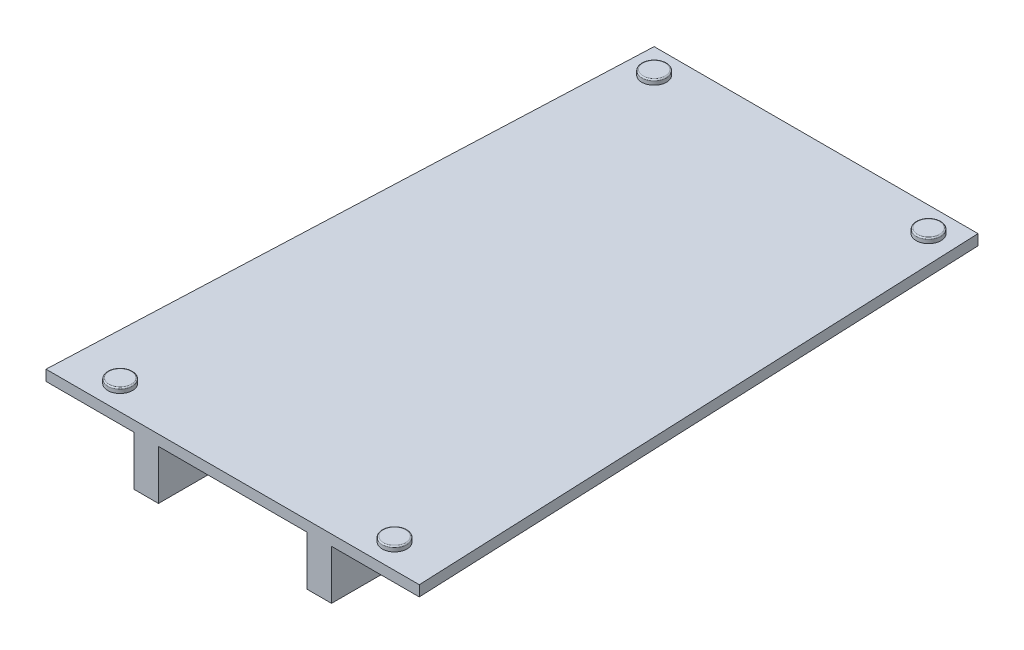
ISO-10303-21;
HEADER;
FILE_DESCRIPTION(('STEP AP214'),'2;1');
FILE_NAME('part.step','',(''),(''),'','','');
FILE_SCHEMA(('AUTOMOTIVE_DESIGN { 1 0 10303 214 1 1 1 1 }'));
ENDSEC;
DATA;
#1=APPLICATION_CONTEXT('core data for automotive mechanical design processes');
#2=APPLICATION_PROTOCOL_DEFINITION('international standard','automotive_design',2000,#1);
#3=PRODUCT_CONTEXT('',#1,'mechanical');
#4=PRODUCT('Part','Part','',(#3));
#5=PRODUCT_RELATED_PRODUCT_CATEGORY('part','',(#4));
#6=PRODUCT_DEFINITION_FORMATION('','',#4);
#7=PRODUCT_DEFINITION_CONTEXT('part definition',#1,'design');
#8=PRODUCT_DEFINITION('design','',#6,#7);
#9=PRODUCT_DEFINITION_SHAPE('','',#8);
#10=(LENGTH_UNIT() NAMED_UNIT(*) SI_UNIT(.MILLI.,.METRE.));
#11=(NAMED_UNIT(*) PLANE_ANGLE_UNIT() SI_UNIT($,.RADIAN.));
#12=(NAMED_UNIT(*) SI_UNIT($,.STERADIAN.) SOLID_ANGLE_UNIT());
#13=UNCERTAINTY_MEASURE_WITH_UNIT(LENGTH_MEASURE(1.E-05),#10,'distance_accuracy_value','');
#14=(GEOMETRIC_REPRESENTATION_CONTEXT(3) GLOBAL_UNCERTAINTY_ASSIGNED_CONTEXT((#13)) GLOBAL_UNIT_ASSIGNED_CONTEXT((#10,
#11,#12)) REPRESENTATION_CONTEXT('',''));
#15=CARTESIAN_POINT('',(0.,0.,0.));
#16=DIRECTION('',(0.,0.,1.));
#17=DIRECTION('',(1.,0.,0.));
#18=AXIS2_PLACEMENT_3D('',#15,#16,#17);
#19=CARTESIAN_POINT('',(0.,0.,0.));
#20=DIRECTION('',(0.,1.,0.));
#21=DIRECTION('',(0.,0.,1.));
#22=AXIS2_PLACEMENT_3D('',#19,#20,#21);
#23=PLANE('',#22);
#24=DIRECTION('',(0.,0.,-1.));
#25=VECTOR('',#24,1.);
#26=CARTESIAN_POINT('',(30.,0.,-118.));
#27=LINE('',#26,#25);
#28=CARTESIAN_POINT('',(30.,0.,118.));
#29=VERTEX_POINT('',#28);
#30=CARTESIAN_POINT('',(30.,0.,-118.));
#31=VERTEX_POINT('',#30);
#32=EDGE_CURVE('E268',#29,#31,#27,.T.);
#33=ORIENTED_EDGE('',*,*,#32,.F.);
#34=DIRECTION('',(1.,0.,0.));
#35=VECTOR('',#34,1.);
#36=CARTESIAN_POINT('',(0.,0.,118.));
#37=LINE('',#36,#35);
#38=CARTESIAN_POINT('',(-30.,0.,118.));
#39=VERTEX_POINT('',#38);
#40=EDGE_CURVE('E63',#39,#29,#37,.T.);
#41=ORIENTED_EDGE('',*,*,#40,.F.);
#42=DIRECTION('',(0.,0.,1.));
#43=VECTOR('',#42,1.);
#44=CARTESIAN_POINT('',(-30.,0.,-118.));
#45=LINE('',#44,#43);
#46=CARTESIAN_POINT('',(-30.,0.,-118.));
#47=VERTEX_POINT('',#46);
#48=EDGE_CURVE('E153',#47,#39,#45,.T.);
#49=ORIENTED_EDGE('',*,*,#48,.F.);
#50=DIRECTION('',(1.,0.,0.));
#51=VECTOR('',#50,1.);
#52=CARTESIAN_POINT('',(0.,0.,-118.));
#53=LINE('',#52,#51);
#54=EDGE_CURVE('E196',#47,#31,#53,.T.);
#55=ORIENTED_EDGE('',*,*,#54,.T.);
#56=EDGE_LOOP('',(#33,#41,#49,#55));
#57=FACE_BOUND('',#56,.T.);
#58=ADVANCED_FACE('F38',(#57),#23,.F.);
#59=DIRECTION('',(0.,0.,1.));
#60=VECTOR('',#59,1.);
#61=CARTESIAN_POINT('',(40.,0.,118.));
#62=LINE('',#61,#60);
#63=CARTESIAN_POINT('',(40.,0.,-118.));
#64=VERTEX_POINT('',#63);
#65=CARTESIAN_POINT('',(40.,0.,118.));
#66=VERTEX_POINT('',#65);
#67=EDGE_CURVE('E145',#64,#66,#62,.T.);
#68=ORIENTED_EDGE('',*,*,#67,.F.);
#69=CARTESIAN_POINT('',(65.5,0.,-118.));
#70=VERTEX_POINT('',#69);
#71=EDGE_CURVE('E180',#64,#70,#53,.T.);
#72=ORIENTED_EDGE('',*,*,#71,.T.);
#73=DIRECTION('',(0.0423348930736045,0.,0.999103476537063));
#74=VECTOR('',#73,1.);
#75=CARTESIAN_POINT('',(70.3736468564055,0.,-2.98193418883075));
#76=LINE('',#75,#74);
#77=CARTESIAN_POINT('',(75.5,0.,118.));
#78=VERTEX_POINT('',#77);
#79=EDGE_CURVE('E185',#70,#78,#76,.T.);
#80=ORIENTED_EDGE('',*,*,#79,.T.);
#81=EDGE_CURVE('E198',#66,#78,#37,.T.);
#82=ORIENTED_EDGE('',*,*,#81,.F.);
#83=EDGE_LOOP('',(#68,#72,#80,#82));
#84=FACE_BOUND('',#83,.T.);
#85=ADVANCED_FACE('F282',(#84),#23,.F.);
#86=DIRECTION('',(0.,0.,-1.));
#87=VECTOR('',#86,1.);
#88=CARTESIAN_POINT('',(-40.,0.,118.));
#89=LINE('',#88,#87);
#90=CARTESIAN_POINT('',(-40.,0.,118.));
#91=VERTEX_POINT('',#90);
#92=CARTESIAN_POINT('',(-40.,0.,-118.));
#93=VERTEX_POINT('',#92);
#94=EDGE_CURVE('E150',#91,#93,#89,.T.);
#95=ORIENTED_EDGE('',*,*,#94,.F.);
#96=CARTESIAN_POINT('',(-75.5,0.,118.));
#97=VERTEX_POINT('',#96);
#98=EDGE_CURVE('E199',#97,#91,#37,.T.);
#99=ORIENTED_EDGE('',*,*,#98,.F.);
#100=DIRECTION('',(-0.0423348930736043,0.,0.999103476537064));
#101=VECTOR('',#100,1.);
#102=CARTESIAN_POINT('',(-70.3736468564055,0.,-2.98193418883073));
#103=LINE('',#102,#101);
#104=CARTESIAN_POINT('',(-65.5,0.,-118.));
#105=VERTEX_POINT('',#104);
#106=EDGE_CURVE('E195',#105,#97,#103,.T.);
#107=ORIENTED_EDGE('',*,*,#106,.F.);
#108=EDGE_CURVE('E193',#105,#93,#53,.T.);
#109=ORIENTED_EDGE('',*,*,#108,.T.);
#110=EDGE_LOOP('',(#95,#99,#107,#109));
#111=FACE_BOUND('',#110,.T.);
#112=ADVANCED_FACE('F303',(#111),#23,.F.);
#113=CARTESIAN_POINT('',(0.,4.3,-118.));
#114=DIRECTION('',(0.,0.,-1.));
#115=DIRECTION('',(-1.,0.,0.));
#116=AXIS2_PLACEMENT_3D('',#113,#114,#115);
#117=PLANE('',#116);
#118=ORIENTED_EDGE('',*,*,#108,.F.);
#119=DIRECTION('',(0.,-1.,0.));
#120=VECTOR('',#119,1.);
#121=CARTESIAN_POINT('',(-65.5,4.3,-118.));
#122=LINE('',#121,#120);
#123=CARTESIAN_POINT('',(-65.5,4.3,-118.));
#124=VERTEX_POINT('',#123);
#125=EDGE_CURVE('E211',#124,#105,#122,.T.);
#126=ORIENTED_EDGE('',*,*,#125,.F.);
#127=DIRECTION('',(1.,0.,0.));
#128=VECTOR('',#127,1.);
#129=CARTESIAN_POINT('',(0.,4.3,-118.));
#130=LINE('',#129,#128);
#131=CARTESIAN_POINT('',(65.5,4.3,-118.));
#132=VERTEX_POINT('',#131);
#133=EDGE_CURVE('E181',#124,#132,#130,.T.);
#134=ORIENTED_EDGE('',*,*,#133,.T.);
#135=DIRECTION('',(0.,-1.,0.));
#136=VECTOR('',#135,1.);
#137=CARTESIAN_POINT('',(65.5,4.3,-118.));
#138=LINE('',#137,#136);
#139=EDGE_CURVE('E192',#132,#70,#138,.T.);
#140=ORIENTED_EDGE('',*,*,#139,.T.);
#141=ORIENTED_EDGE('',*,*,#71,.F.);
#142=DIRECTION('',(0.,1.,0.));
#143=VECTOR('',#142,1.);
#144=CARTESIAN_POINT('',(40.,-20.,-118.));
#145=LINE('',#144,#143);
#146=CARTESIAN_POINT('',(40.,-20.,-118.));
#147=VERTEX_POINT('',#146);
#148=EDGE_CURVE('E155',#147,#64,#145,.T.);
#149=ORIENTED_EDGE('',*,*,#148,.F.);
#150=DIRECTION('',(1.,0.,0.));
#151=VECTOR('',#150,1.);
#152=CARTESIAN_POINT('',(40.,-20.,-118.));
#153=LINE('',#152,#151);
#154=CARTESIAN_POINT('',(30.,-20.,-118.));
#155=VERTEX_POINT('',#154);
#156=EDGE_CURVE('E139',#155,#147,#153,.T.);
#157=ORIENTED_EDGE('',*,*,#156,.F.);
#158=DIRECTION('',(0.,1.,0.));
#159=VECTOR('',#158,1.);
#160=CARTESIAN_POINT('',(30.,-20.,-118.));
#161=LINE('',#160,#159);
#162=EDGE_CURVE('E136',#155,#31,#161,.T.);
#163=ORIENTED_EDGE('',*,*,#162,.T.);
#164=ORIENTED_EDGE('',*,*,#54,.F.);
#165=DIRECTION('',(0.,1.,0.));
#166=VECTOR('',#165,1.);
#167=CARTESIAN_POINT('',(-30.,-20.,-118.));
#168=LINE('',#167,#166);
#169=CARTESIAN_POINT('',(-30.,-20.,-118.));
#170=VERTEX_POINT('',#169);
#171=EDGE_CURVE('E171',#170,#47,#168,.T.);
#172=ORIENTED_EDGE('',*,*,#171,.F.);
#173=DIRECTION('',(1.,0.,0.));
#174=VECTOR('',#173,1.);
#175=CARTESIAN_POINT('',(-40.,-20.,-118.));
#176=LINE('',#175,#174);
#177=CARTESIAN_POINT('',(-40.,-20.,-118.));
#178=VERTEX_POINT('',#177);
#179=EDGE_CURVE('E164',#178,#170,#176,.T.);
#180=ORIENTED_EDGE('',*,*,#179,.F.);
#181=DIRECTION('',(0.,1.,0.));
#182=VECTOR('',#181,1.);
#183=CARTESIAN_POINT('',(-40.,-20.,-118.));
#184=LINE('',#183,#182);
#185=EDGE_CURVE('E174',#178,#93,#184,.T.);
#186=ORIENTED_EDGE('',*,*,#185,.T.);
#187=EDGE_LOOP('',(#118,#126,#134,#140,#141,#149,#157,#163,#164,#172,#180,#186));
#188=FACE_BOUND('',#187,.T.);
#189=ADVANCED_FACE('F284',(#188),#117,.T.);
#190=CARTESIAN_POINT('',(-70.3736468564055,4.3,-2.98193418883073));
#191=DIRECTION('',(0.999103476537063,0.,0.0423348930736043));
#192=DIRECTION('',(0.0423348930736043,0.,-0.999103476537064));
#193=AXIS2_PLACEMENT_3D('',#190,#191,#192);
#194=PLANE('',#193);
#195=ORIENTED_EDGE('',*,*,#106,.T.);
#196=DIRECTION('',(0.,-1.,0.));
#197=VECTOR('',#196,1.);
#198=CARTESIAN_POINT('',(-75.5,4.3,118.));
#199=LINE('',#198,#197);
#200=CARTESIAN_POINT('',(-75.5,4.3,118.));
#201=VERTEX_POINT('',#200);
#202=EDGE_CURVE('E208',#201,#97,#199,.T.);
#203=ORIENTED_EDGE('',*,*,#202,.F.);
#204=DIRECTION('',(-0.0423348930736043,0.,0.999103476537064));
#205=VECTOR('',#204,1.);
#206=CARTESIAN_POINT('',(-70.3736468564055,4.3,-2.98193418883073));
#207=LINE('',#206,#205);
#208=EDGE_CURVE('E184',#124,#201,#207,.T.);
#209=ORIENTED_EDGE('',*,*,#208,.F.);
#210=ORIENTED_EDGE('',*,*,#125,.T.);
#211=EDGE_LOOP('',(#195,#203,#209,#210));
#212=FACE_BOUND('',#211,.T.);
#213=ADVANCED_FACE('F310',(#212),#194,.F.);
#214=CARTESIAN_POINT('',(0.,4.3,118.));
#215=DIRECTION('',(0.,0.,-1.));
#216=DIRECTION('',(-1.,0.,0.));
#217=AXIS2_PLACEMENT_3D('',#214,#215,#216);
#218=PLANE('',#217);
#219=ORIENTED_EDGE('',*,*,#98,.T.);
#220=DIRECTION('',(0.,1.,0.));
#221=VECTOR('',#220,1.);
#222=CARTESIAN_POINT('',(-40.,-20.,118.));
#223=LINE('',#222,#221);
#224=CARTESIAN_POINT('',(-40.,-20.,118.));
#225=VERTEX_POINT('',#224);
#226=EDGE_CURVE('E177',#225,#91,#223,.T.);
#227=ORIENTED_EDGE('',*,*,#226,.F.);
#228=DIRECTION('',(-1.,0.,0.));
#229=VECTOR('',#228,1.);
#230=CARTESIAN_POINT('',(-30.,-20.,118.));
#231=LINE('',#230,#229);
#232=CARTESIAN_POINT('',(-30.,-20.,118.));
#233=VERTEX_POINT('',#232);
#234=EDGE_CURVE('E159',#233,#225,#231,.T.);
#235=ORIENTED_EDGE('',*,*,#234,.F.);
#236=DIRECTION('',(0.,1.,0.));
#237=VECTOR('',#236,1.);
#238=CARTESIAN_POINT('',(-30.,-20.,118.));
#239=LINE('',#238,#237);
#240=EDGE_CURVE('E167',#233,#39,#239,.T.);
#241=ORIENTED_EDGE('',*,*,#240,.T.);
#242=ORIENTED_EDGE('',*,*,#40,.T.);
#243=DIRECTION('',(0.,1.,0.));
#244=VECTOR('',#243,1.);
#245=CARTESIAN_POINT('',(30.,-20.,118.));
#246=LINE('',#245,#244);
#247=CARTESIAN_POINT('',(30.,-20.,118.));
#248=VERTEX_POINT('',#247);
#249=EDGE_CURVE('E134',#248,#29,#246,.T.);
#250=ORIENTED_EDGE('',*,*,#249,.F.);
#251=DIRECTION('',(-1.,0.,0.));
#252=VECTOR('',#251,1.);
#253=CARTESIAN_POINT('',(30.,-20.,118.));
#254=LINE('',#253,#252);
#255=CARTESIAN_POINT('',(40.,-20.,118.));
#256=VERTEX_POINT('',#255);
#257=EDGE_CURVE('E140',#256,#248,#254,.T.);
#258=ORIENTED_EDGE('',*,*,#257,.F.);
#259=DIRECTION('',(0.,1.,0.));
#260=VECTOR('',#259,1.);
#261=CARTESIAN_POINT('',(40.,-20.,118.));
#262=LINE('',#261,#260);
#263=EDGE_CURVE('E55',#256,#66,#262,.T.);
#264=ORIENTED_EDGE('',*,*,#263,.T.);
#265=ORIENTED_EDGE('',*,*,#81,.T.);
#266=DIRECTION('',(0.,-1.,0.));
#267=VECTOR('',#266,1.);
#268=CARTESIAN_POINT('',(75.5,4.3,118.));
#269=LINE('',#268,#267);
#270=CARTESIAN_POINT('',(75.5,4.3,118.));
#271=VERTEX_POINT('',#270);
#272=EDGE_CURVE('E205',#271,#78,#269,.T.);
#273=ORIENTED_EDGE('',*,*,#272,.F.);
#274=DIRECTION('',(1.,0.,0.));
#275=VECTOR('',#274,1.);
#276=CARTESIAN_POINT('',(0.,4.3,118.));
#277=LINE('',#276,#275);
#278=EDGE_CURVE('E187',#201,#271,#277,.T.);
#279=ORIENTED_EDGE('',*,*,#278,.F.);
#280=ORIENTED_EDGE('',*,*,#202,.T.);
#281=EDGE_LOOP('',(#219,#227,#235,#241,#242,#250,#258,#264,#265,#273,#279,#280));
#282=FACE_BOUND('',#281,.T.);
#283=ADVANCED_FACE('F148',(#282),#218,.F.);
#284=CARTESIAN_POINT('',(70.3736468564055,4.3,-2.98193418883075));
#285=DIRECTION('',(0.999103476537063,0.,-0.0423348930736045));
#286=DIRECTION('',(-0.0423348930736045,0.,-0.999103476537064));
#287=AXIS2_PLACEMENT_3D('',#284,#285,#286);
#288=PLANE('',#287);
#289=ORIENTED_EDGE('',*,*,#79,.F.);
#290=ORIENTED_EDGE('',*,*,#139,.F.);
#291=DIRECTION('',(0.0423348930736045,0.,0.999103476537063));
#292=VECTOR('',#291,1.);
#293=CARTESIAN_POINT('',(70.3736468564055,4.3,-2.98193418883075));
#294=LINE('',#293,#292);
#295=EDGE_CURVE('E189',#132,#271,#294,.T.);
#296=ORIENTED_EDGE('',*,*,#295,.T.);
#297=ORIENTED_EDGE('',*,*,#272,.T.);
#298=EDGE_LOOP('',(#289,#290,#296,#297));
#299=FACE_BOUND('',#298,.T.);
#300=ADVANCED_FACE('F316',(#299),#288,.T.);
#301=CARTESIAN_POINT('',(0.,4.3,0.));
#302=DIRECTION('',(0.,1.,0.));
#303=DIRECTION('',(0.,0.,1.));
#304=AXIS2_PLACEMENT_3D('',#301,#302,#303);
#305=PLANE('',#304);
#306=CARTESIAN_POINT('',(55.5,4.3,108.));
#307=DIRECTION('',(0.,1.,0.));
#308=DIRECTION('',(0.,0.,1.));
#309=AXIS2_PLACEMENT_3D('',#306,#307,#308);
#310=CIRCLE('',#309,5.);
#311=CARTESIAN_POINT('',(55.5,4.3,113.));
#312=VERTEX_POINT('',#311);
#313=EDGE_CURVE('E257',#312,#312,#310,.T.);
#314=ORIENTED_EDGE('',*,*,#313,.F.);
#315=EDGE_LOOP('',(#314));
#316=FACE_BOUND('',#315,.T.);
#317=CARTESIAN_POINT('',(-55.5,4.3,108.));
#318=DIRECTION('',(0.,1.,0.));
#319=DIRECTION('',(0.,0.,-1.));
#320=AXIS2_PLACEMENT_3D('',#317,#318,#319);
#321=CIRCLE('',#320,5.);
#322=CARTESIAN_POINT('',(-55.5,4.3,103.));
#323=VERTEX_POINT('',#322);
#324=EDGE_CURVE('E260',#323,#323,#321,.T.);
#325=ORIENTED_EDGE('',*,*,#324,.F.);
#326=EDGE_LOOP('',(#325));
#327=FACE_BOUND('',#326,.T.);
#328=CARTESIAN_POINT('',(55.5,4.3,-108.));
#329=DIRECTION('',(0.,1.,0.));
#330=DIRECTION('',(0.,0.,-1.));
#331=AXIS2_PLACEMENT_3D('',#328,#329,#330);
#332=CIRCLE('',#331,5.);
#333=CARTESIAN_POINT('',(55.5,4.3,-113.));
#334=VERTEX_POINT('',#333);
#335=EDGE_CURVE('E263',#334,#334,#332,.T.);
#336=ORIENTED_EDGE('',*,*,#335,.F.);
#337=EDGE_LOOP('',(#336));
#338=FACE_BOUND('',#337,.T.);
#339=CARTESIAN_POINT('',(-55.5,4.3,-108.));
#340=DIRECTION('',(0.,1.,0.));
#341=DIRECTION('',(0.,0.,1.));
#342=AXIS2_PLACEMENT_3D('',#339,#340,#341);
#343=CIRCLE('',#342,5.);
#344=CARTESIAN_POINT('',(-55.5,4.3,-103.));
#345=VERTEX_POINT('',#344);
#346=EDGE_CURVE('E266',#345,#345,#343,.T.);
#347=ORIENTED_EDGE('',*,*,#346,.F.);
#348=EDGE_LOOP('',(#347));
#349=FACE_BOUND('',#348,.T.);
#350=ORIENTED_EDGE('',*,*,#133,.F.);
#351=ORIENTED_EDGE('',*,*,#208,.T.);
#352=ORIENTED_EDGE('',*,*,#278,.T.);
#353=ORIENTED_EDGE('',*,*,#295,.F.);
#354=EDGE_LOOP('',(#350,#351,#352,#353));
#355=FACE_BOUND('',#354,.T.);
#356=ADVANCED_FACE('F314',(#316,#327,#338,#349,#355),#305,.T.);
#357=CARTESIAN_POINT('',(-40.,-20.,118.));
#358=DIRECTION('',(1.,0.,0.));
#359=DIRECTION('',(0.,0.,-1.));
#360=AXIS2_PLACEMENT_3D('',#357,#358,#359);
#361=PLANE('',#360);
#362=CARTESIAN_POINT('',(-40.,-9.99999999999998,-59.));
#363=DIRECTION('',(1.,0.,0.));
#364=DIRECTION('',(0.,0.,-1.));
#365=AXIS2_PLACEMENT_3D('',#362,#363,#364);
#366=CIRCLE('',#365,2.5);
#367=CARTESIAN_POINT('',(-40.,-9.99999999999998,-61.5));
#368=VERTEX_POINT('',#367);
#369=EDGE_CURVE('E254',#368,#368,#366,.T.);
#370=ORIENTED_EDGE('',*,*,#369,.T.);
#371=EDGE_LOOP('',(#370));
#372=FACE_BOUND('',#371,.T.);
#373=CARTESIAN_POINT('',(-40.,-9.99999999999997,59.));
#374=DIRECTION('',(1.,0.,0.));
#375=DIRECTION('',(0.,0.,-1.));
#376=AXIS2_PLACEMENT_3D('',#373,#374,#375);
#377=CIRCLE('',#376,2.50000000000007);
#378=CARTESIAN_POINT('',(-40.,-9.99999999999997,56.4999999999999));
#379=VERTEX_POINT('',#378);
#380=EDGE_CURVE('E243',#379,#379,#377,.T.);
#381=ORIENTED_EDGE('',*,*,#380,.T.);
#382=EDGE_LOOP('',(#381));
#383=FACE_BOUND('',#382,.T.);
#384=ORIENTED_EDGE('',*,*,#94,.T.);
#385=ORIENTED_EDGE('',*,*,#185,.F.);
#386=DIRECTION('',(0.,0.,-1.));
#387=VECTOR('',#386,1.);
#388=CARTESIAN_POINT('',(-40.,-20.,118.));
#389=LINE('',#388,#387);
#390=EDGE_CURVE('E162',#225,#178,#389,.T.);
#391=ORIENTED_EDGE('',*,*,#390,.F.);
#392=ORIENTED_EDGE('',*,*,#226,.T.);
#393=EDGE_LOOP('',(#384,#385,#391,#392));
#394=FACE_BOUND('',#393,.T.);
#395=ADVANCED_FACE('F300',(#372,#383,#394),#361,.F.);
#396=CARTESIAN_POINT('',(-30.,-20.,-118.));
#397=DIRECTION('',(-1.,0.,0.));
#398=DIRECTION('',(0.,0.,1.));
#399=AXIS2_PLACEMENT_3D('',#396,#397,#398);
#400=PLANE('',#399);
#401=CARTESIAN_POINT('',(-30.,-9.99999999999998,-59.));
#402=DIRECTION('',(-1.,0.,0.));
#403=DIRECTION('',(0.,0.,1.));
#404=AXIS2_PLACEMENT_3D('',#401,#402,#403);
#405=CIRCLE('',#404,2.5);
#406=CARTESIAN_POINT('',(-30.,-9.99999999999998,-56.5));
#407=VERTEX_POINT('',#406);
#408=EDGE_CURVE('E251',#407,#407,#405,.T.);
#409=ORIENTED_EDGE('',*,*,#408,.T.);
#410=EDGE_LOOP('',(#409));
#411=FACE_BOUND('',#410,.T.);
#412=CARTESIAN_POINT('',(-30.,-9.99999999999997,59.));
#413=DIRECTION('',(-1.,0.,0.));
#414=DIRECTION('',(0.,0.,1.));
#415=AXIS2_PLACEMENT_3D('',#412,#413,#414);
#416=CIRCLE('',#415,2.50000000000007);
#417=CARTESIAN_POINT('',(-30.,-9.99999999999997,61.5000000000001));
#418=VERTEX_POINT('',#417);
#419=EDGE_CURVE('E238',#418,#418,#416,.T.);
#420=ORIENTED_EDGE('',*,*,#419,.T.);
#421=EDGE_LOOP('',(#420));
#422=FACE_BOUND('',#421,.T.);
#423=ORIENTED_EDGE('',*,*,#48,.T.);
#424=ORIENTED_EDGE('',*,*,#240,.F.);
#425=DIRECTION('',(0.,0.,1.));
#426=VECTOR('',#425,1.);
#427=CARTESIAN_POINT('',(-30.,-20.,-118.));
#428=LINE('',#427,#426);
#429=EDGE_CURVE('E166',#170,#233,#428,.T.);
#430=ORIENTED_EDGE('',*,*,#429,.F.);
#431=ORIENTED_EDGE('',*,*,#171,.T.);
#432=EDGE_LOOP('',(#423,#424,#430,#431));
#433=FACE_BOUND('',#432,.T.);
#434=ADVANCED_FACE('F292',(#411,#422,#433),#400,.F.);
#435=CARTESIAN_POINT('',(0.,-20.,0.));
#436=DIRECTION('',(0.,-1.,0.));
#437=DIRECTION('',(0.,0.,-1.));
#438=AXIS2_PLACEMENT_3D('',#435,#436,#437);
#439=PLANE('',#438);
#440=ORIENTED_EDGE('',*,*,#234,.T.);
#441=ORIENTED_EDGE('',*,*,#390,.T.);
#442=ORIENTED_EDGE('',*,*,#179,.T.);
#443=ORIENTED_EDGE('',*,*,#429,.T.);
#444=EDGE_LOOP('',(#440,#441,#442,#443));
#445=FACE_BOUND('',#444,.T.);
#446=ADVANCED_FACE('F296',(#445),#439,.T.);
#447=CARTESIAN_POINT('',(30.,-20.,-118.));
#448=DIRECTION('',(1.,0.,0.));
#449=DIRECTION('',(0.,0.,-1.));
#450=AXIS2_PLACEMENT_3D('',#447,#448,#449);
#451=PLANE('',#450);
#452=CARTESIAN_POINT('',(30.,-9.99999999999998,-59.));
#453=DIRECTION('',(1.,0.,0.));
#454=DIRECTION('',(0.,0.,-1.));
#455=AXIS2_PLACEMENT_3D('',#452,#453,#454);
#456=CIRCLE('',#455,2.5);
#457=CARTESIAN_POINT('',(30.,-9.99999999999998,-61.5));
#458=VERTEX_POINT('',#457);
#459=EDGE_CURVE('E248',#458,#458,#456,.T.);
#460=ORIENTED_EDGE('',*,*,#459,.T.);
#461=EDGE_LOOP('',(#460));
#462=FACE_BOUND('',#461,.T.);
#463=CARTESIAN_POINT('',(30.,-9.99999999999997,59.));
#464=DIRECTION('',(1.,0.,0.));
#465=DIRECTION('',(0.,0.,-1.));
#466=AXIS2_PLACEMENT_3D('',#463,#464,#465);
#467=CIRCLE('',#466,2.50000000000007);
#468=CARTESIAN_POINT('',(30.,-9.99999999999997,56.4999999999999));
#469=VERTEX_POINT('',#468);
#470=EDGE_CURVE('E234',#469,#469,#467,.T.);
#471=ORIENTED_EDGE('',*,*,#470,.T.);
#472=EDGE_LOOP('',(#471));
#473=FACE_BOUND('',#472,.T.);
#474=ORIENTED_EDGE('',*,*,#32,.T.);
#475=ORIENTED_EDGE('',*,*,#162,.F.);
#476=DIRECTION('',(0.,0.,-1.));
#477=VECTOR('',#476,1.);
#478=CARTESIAN_POINT('',(30.,-20.,-118.));
#479=LINE('',#478,#477);
#480=EDGE_CURVE('E130',#248,#155,#479,.T.);
#481=ORIENTED_EDGE('',*,*,#480,.F.);
#482=ORIENTED_EDGE('',*,*,#249,.T.);
#483=EDGE_LOOP('',(#474,#475,#481,#482));
#484=FACE_BOUND('',#483,.T.);
#485=ADVANCED_FACE('F132',(#462,#473,#484),#451,.F.);
#486=CARTESIAN_POINT('',(40.,-20.,118.));
#487=DIRECTION('',(-1.,0.,0.));
#488=DIRECTION('',(0.,0.,1.));
#489=AXIS2_PLACEMENT_3D('',#486,#487,#488);
#490=PLANE('',#489);
#491=CARTESIAN_POINT('',(40.,-9.99999999999998,-59.));
#492=DIRECTION('',(-1.,0.,0.));
#493=DIRECTION('',(0.,0.,1.));
#494=AXIS2_PLACEMENT_3D('',#491,#492,#493);
#495=CIRCLE('',#494,2.5);
#496=CARTESIAN_POINT('',(40.,-9.99999999999998,-56.5));
#497=VERTEX_POINT('',#496);
#498=EDGE_CURVE('E42',#497,#497,#495,.T.);
#499=ORIENTED_EDGE('',*,*,#498,.T.);
#500=EDGE_LOOP('',(#499));
#501=FACE_BOUND('',#500,.T.);
#502=CARTESIAN_POINT('',(40.,-9.99999999999997,59.));
#503=DIRECTION('',(-1.,0.,0.));
#504=DIRECTION('',(0.,0.,1.));
#505=AXIS2_PLACEMENT_3D('',#502,#503,#504);
#506=CIRCLE('',#505,2.50000000000007);
#507=CARTESIAN_POINT('',(40.,-9.99999999999997,61.5000000000001));
#508=VERTEX_POINT('',#507);
#509=EDGE_CURVE('E232',#508,#508,#506,.T.);
#510=ORIENTED_EDGE('',*,*,#509,.T.);
#511=EDGE_LOOP('',(#510));
#512=FACE_BOUND('',#511,.T.);
#513=ORIENTED_EDGE('',*,*,#67,.T.);
#514=ORIENTED_EDGE('',*,*,#263,.F.);
#515=DIRECTION('',(0.,0.,1.));
#516=VECTOR('',#515,1.);
#517=CARTESIAN_POINT('',(40.,-20.,118.));
#518=LINE('',#517,#516);
#519=EDGE_CURVE('E144',#147,#256,#518,.T.);
#520=ORIENTED_EDGE('',*,*,#519,.F.);
#521=ORIENTED_EDGE('',*,*,#148,.T.);
#522=EDGE_LOOP('',(#513,#514,#520,#521));
#523=FACE_BOUND('',#522,.T.);
#524=ADVANCED_FACE('F277',(#501,#512,#523),#490,.F.);
#525=CARTESIAN_POINT('',(0.,-20.,0.));
#526=DIRECTION('',(0.,1.,0.));
#527=DIRECTION('',(0.,0.,1.));
#528=AXIS2_PLACEMENT_3D('',#525,#526,#527);
#529=PLANE('',#528);
#530=ORIENTED_EDGE('',*,*,#257,.T.);
#531=ORIENTED_EDGE('',*,*,#480,.T.);
#532=ORIENTED_EDGE('',*,*,#156,.T.);
#533=ORIENTED_EDGE('',*,*,#519,.T.);
#534=EDGE_LOOP('',(#530,#531,#532,#533));
#535=FACE_BOUND('',#534,.T.);
#536=ADVANCED_FACE('F142',(#535),#529,.F.);
#537=CARTESIAN_POINT('',(-55.5,6.3,-108.));
#538=DIRECTION('',(0.,-1.,0.));
#539=DIRECTION('',(0.,0.,-1.));
#540=AXIS2_PLACEMENT_3D('',#537,#538,#539);
#541=CYLINDRICAL_SURFACE('',#540,5.);
#542=CARTESIAN_POINT('',(-55.5,5.8,-108.));
#543=DIRECTION('',(0.,1.,0.));
#544=DIRECTION('',(0.,0.,1.));
#545=AXIS2_PLACEMENT_3D('',#542,#543,#544);
#546=CIRCLE('',#545,5.);
#547=CARTESIAN_POINT('',(-55.5,5.8,-103.));
#548=VERTEX_POINT('',#547);
#549=EDGE_CURVE('E216',#548,#548,#546,.F.);
#550=ORIENTED_EDGE('',*,*,#549,.T.);
#551=EDGE_LOOP('',(#550));
#552=FACE_BOUND('',#551,.T.);
#553=ORIENTED_EDGE('',*,*,#346,.T.);
#554=EDGE_LOOP('',(#553));
#555=FACE_BOUND('',#554,.T.);
#556=ADVANCED_FACE('F392',(#552,#555),#541,.T.);
#557=CARTESIAN_POINT('',(-55.5,6.3,-108.));
#558=DIRECTION('',(0.,1.,0.));
#559=DIRECTION('',(0.,0.,1.));
#560=AXIS2_PLACEMENT_3D('',#557,#558,#559);
#561=PLANE('',#560);
#562=CARTESIAN_POINT('',(-55.5,6.3,-108.));
#563=DIRECTION('',(0.,1.,0.));
#564=DIRECTION('',(0.,0.,1.));
#565=AXIS2_PLACEMENT_3D('',#562,#563,#564);
#566=CIRCLE('',#565,4.5);
#567=CARTESIAN_POINT('',(-55.5,6.3,-103.5));
#568=VERTEX_POINT('',#567);
#569=EDGE_CURVE('E213',#568,#568,#566,.T.);
#570=ORIENTED_EDGE('',*,*,#569,.T.);
#571=EDGE_LOOP('',(#570));
#572=FACE_BOUND('',#571,.T.);
#573=ADVANCED_FACE('F388',(#572),#561,.T.);
#574=CARTESIAN_POINT('',(55.5,6.3,-108.));
#575=DIRECTION('',(0.,-1.,0.));
#576=DIRECTION('',(0.,0.,-1.));
#577=AXIS2_PLACEMENT_3D('',#574,#575,#576);
#578=CYLINDRICAL_SURFACE('',#577,5.);
#579=CARTESIAN_POINT('',(55.5,5.8,-108.));
#580=DIRECTION('',(0.,-1.,0.));
#581=DIRECTION('',(0.,0.,-1.));
#582=AXIS2_PLACEMENT_3D('',#579,#580,#581);
#583=CIRCLE('',#582,5.);
#584=CARTESIAN_POINT('',(55.5,5.8,-113.));
#585=VERTEX_POINT('',#584);
#586=EDGE_CURVE('E11',#585,#585,#583,.T.);
#587=ORIENTED_EDGE('',*,*,#586,.T.);
#588=EDGE_LOOP('',(#587));
#589=FACE_BOUND('',#588,.T.);
#590=ORIENTED_EDGE('',*,*,#335,.T.);
#591=EDGE_LOOP('',(#590));
#592=FACE_BOUND('',#591,.T.);
#593=ADVANCED_FACE('F384',(#589,#592),#578,.T.);
#594=CARTESIAN_POINT('',(55.5,6.3,-108.));
#595=DIRECTION('',(0.,-1.,0.));
#596=DIRECTION('',(0.,0.,-1.));
#597=AXIS2_PLACEMENT_3D('',#594,#595,#596);
#598=PLANE('',#597);
#599=CARTESIAN_POINT('',(55.5,6.3,-108.));
#600=DIRECTION('',(0.,-1.,0.));
#601=DIRECTION('',(0.,0.,-1.));
#602=AXIS2_PLACEMENT_3D('',#599,#600,#601);
#603=CIRCLE('',#602,4.5);
#604=CARTESIAN_POINT('',(55.5,6.3,-112.5));
#605=VERTEX_POINT('',#604);
#606=EDGE_CURVE('E47',#605,#605,#603,.F.);
#607=ORIENTED_EDGE('',*,*,#606,.T.);
#608=EDGE_LOOP('',(#607));
#609=FACE_BOUND('',#608,.T.);
#610=ADVANCED_FACE('F380',(#609),#598,.F.);
#611=CARTESIAN_POINT('',(-55.5,6.3,108.));
#612=DIRECTION('',(0.,-1.,0.));
#613=DIRECTION('',(0.,0.,-1.));
#614=AXIS2_PLACEMENT_3D('',#611,#612,#613);
#615=CYLINDRICAL_SURFACE('',#614,5.);
#616=CARTESIAN_POINT('',(-55.5,5.8,108.));
#617=DIRECTION('',(0.,-1.,0.));
#618=DIRECTION('',(0.,0.,-1.));
#619=AXIS2_PLACEMENT_3D('',#616,#617,#618);
#620=CIRCLE('',#619,5.);
#621=CARTESIAN_POINT('',(-55.5,5.8,103.));
#622=VERTEX_POINT('',#621);
#623=EDGE_CURVE('E222',#622,#622,#620,.T.);
#624=ORIENTED_EDGE('',*,*,#623,.T.);
#625=EDGE_LOOP('',(#624));
#626=FACE_BOUND('',#625,.T.);
#627=ORIENTED_EDGE('',*,*,#324,.T.);
#628=EDGE_LOOP('',(#627));
#629=FACE_BOUND('',#628,.T.);
#630=ADVANCED_FACE('F376',(#626,#629),#615,.T.);
#631=CARTESIAN_POINT('',(-55.5,6.3,108.));
#632=DIRECTION('',(0.,-1.,0.));
#633=DIRECTION('',(0.,0.,-1.));
#634=AXIS2_PLACEMENT_3D('',#631,#632,#633);
#635=PLANE('',#634);
#636=CARTESIAN_POINT('',(-55.5,6.3,108.));
#637=DIRECTION('',(0.,-1.,0.));
#638=DIRECTION('',(0.,0.,-1.));
#639=AXIS2_PLACEMENT_3D('',#636,#637,#638);
#640=CIRCLE('',#639,4.5);
#641=CARTESIAN_POINT('',(-55.5,6.3,103.5));
#642=VERTEX_POINT('',#641);
#643=EDGE_CURVE('E219',#642,#642,#640,.F.);
#644=ORIENTED_EDGE('',*,*,#643,.T.);
#645=EDGE_LOOP('',(#644));
#646=FACE_BOUND('',#645,.T.);
#647=ADVANCED_FACE('F367',(#646),#635,.F.);
#648=CARTESIAN_POINT('',(55.5,6.3,108.));
#649=DIRECTION('',(0.,-1.,0.));
#650=DIRECTION('',(0.,0.,-1.));
#651=AXIS2_PLACEMENT_3D('',#648,#649,#650);
#652=CYLINDRICAL_SURFACE('',#651,5.);
#653=CARTESIAN_POINT('',(55.5,5.8,108.));
#654=DIRECTION('',(0.,1.,0.));
#655=DIRECTION('',(0.,0.,1.));
#656=AXIS2_PLACEMENT_3D('',#653,#654,#655);
#657=CIRCLE('',#656,5.);
#658=CARTESIAN_POINT('',(55.5,5.8,113.));
#659=VERTEX_POINT('',#658);
#660=EDGE_CURVE('E228',#659,#659,#657,.F.);
#661=ORIENTED_EDGE('',*,*,#660,.T.);
#662=EDGE_LOOP('',(#661));
#663=FACE_BOUND('',#662,.T.);
#664=ORIENTED_EDGE('',*,*,#313,.T.);
#665=EDGE_LOOP('',(#664));
#666=FACE_BOUND('',#665,.T.);
#667=ADVANCED_FACE('F362',(#663,#666),#652,.T.);
#668=CARTESIAN_POINT('',(55.5,6.3,108.));
#669=DIRECTION('',(0.,1.,0.));
#670=DIRECTION('',(0.,0.,1.));
#671=AXIS2_PLACEMENT_3D('',#668,#669,#670);
#672=PLANE('',#671);
#673=CARTESIAN_POINT('',(55.5,6.3,108.));
#674=DIRECTION('',(0.,1.,0.));
#675=DIRECTION('',(0.,0.,1.));
#676=AXIS2_PLACEMENT_3D('',#673,#674,#675);
#677=CIRCLE('',#676,4.5);
#678=CARTESIAN_POINT('',(55.5,6.3,112.5));
#679=VERTEX_POINT('',#678);
#680=EDGE_CURVE('E225',#679,#679,#677,.T.);
#681=ORIENTED_EDGE('',*,*,#680,.T.);
#682=EDGE_LOOP('',(#681));
#683=FACE_BOUND('',#682,.T.);
#684=ADVANCED_FACE('F345',(#683),#672,.T.);
#685=CARTESIAN_POINT('',(-55.5,5.8,-108.));
#686=DIRECTION('',(0.,1.,0.));
#687=DIRECTION('',(0.,0.,1.));
#688=AXIS2_PLACEMENT_3D('',#685,#686,#687);
#689=TOROIDAL_SURFACE('',#688,4.5,0.5);
#690=ORIENTED_EDGE('',*,*,#549,.F.);
#691=EDGE_LOOP('',(#690));
#692=FACE_BOUND('',#691,.T.);
#693=ORIENTED_EDGE('',*,*,#569,.F.);
#694=EDGE_LOOP('',(#693));
#695=FACE_BOUND('',#694,.T.);
#696=ADVANCED_FACE('F341',(#692,#695),#689,.T.);
#697=CARTESIAN_POINT('',(-55.5,5.8,108.));
#698=DIRECTION('',(0.,-1.,0.));
#699=DIRECTION('',(0.,0.,-1.));
#700=AXIS2_PLACEMENT_3D('',#697,#698,#699);
#701=TOROIDAL_SURFACE('',#700,4.5,0.5);
#702=ORIENTED_EDGE('',*,*,#623,.F.);
#703=EDGE_LOOP('',(#702));
#704=FACE_BOUND('',#703,.T.);
#705=ORIENTED_EDGE('',*,*,#643,.F.);
#706=EDGE_LOOP('',(#705));
#707=FACE_BOUND('',#706,.T.);
#708=ADVANCED_FACE('F344',(#704,#707),#701,.T.);
#709=CARTESIAN_POINT('',(55.5,5.8,108.));
#710=DIRECTION('',(0.,1.,0.));
#711=DIRECTION('',(0.,0.,1.));
#712=AXIS2_PLACEMENT_3D('',#709,#710,#711);
#713=TOROIDAL_SURFACE('',#712,4.5,0.5);
#714=ORIENTED_EDGE('',*,*,#660,.F.);
#715=EDGE_LOOP('',(#714));
#716=FACE_BOUND('',#715,.T.);
#717=ORIENTED_EDGE('',*,*,#680,.F.);
#718=EDGE_LOOP('',(#717));
#719=FACE_BOUND('',#718,.T.);
#720=ADVANCED_FACE('F348',(#716,#719),#713,.T.);
#721=CARTESIAN_POINT('',(55.5,5.8,-108.));
#722=DIRECTION('',(0.,-1.,0.));
#723=DIRECTION('',(0.,0.,-1.));
#724=AXIS2_PLACEMENT_3D('',#721,#722,#723);
#725=TOROIDAL_SURFACE('',#724,4.5,0.5);
#726=ORIENTED_EDGE('',*,*,#586,.F.);
#727=EDGE_LOOP('',(#726));
#728=FACE_BOUND('',#727,.T.);
#729=ORIENTED_EDGE('',*,*,#606,.F.);
#730=EDGE_LOOP('',(#729));
#731=FACE_BOUND('',#730,.T.);
#732=ADVANCED_FACE('F40',(#728,#731),#725,.T.);
#733=CARTESIAN_POINT('',(75.5,-9.99999999999997,59.));
#734=DIRECTION('',(-1.,0.,0.));
#735=DIRECTION('',(0.,0.,1.));
#736=AXIS2_PLACEMENT_3D('',#733,#734,#735);
#737=CYLINDRICAL_SURFACE('',#736,2.50000000000007);
#738=ORIENTED_EDGE('',*,*,#509,.F.);
#739=EDGE_LOOP('',(#738));
#740=FACE_BOUND('',#739,.T.);
#741=ORIENTED_EDGE('',*,*,#470,.F.);
#742=EDGE_LOOP('',(#741));
#743=FACE_BOUND('',#742,.T.);
#744=ADVANCED_FACE('F355',(#740,#743),#737,.F.);
#745=CARTESIAN_POINT('',(75.5,-9.99999999999998,-59.));
#746=DIRECTION('',(-1.,0.,0.));
#747=DIRECTION('',(0.,0.,1.));
#748=AXIS2_PLACEMENT_3D('',#745,#746,#747);
#749=CYLINDRICAL_SURFACE('',#748,2.5);
#750=ORIENTED_EDGE('',*,*,#498,.F.);
#751=EDGE_LOOP('',(#750));
#752=FACE_BOUND('',#751,.T.);
#753=ORIENTED_EDGE('',*,*,#459,.F.);
#754=EDGE_LOOP('',(#753));
#755=FACE_BOUND('',#754,.T.);
#756=ADVANCED_FACE('F420',(#752,#755),#749,.F.);
#757=ORIENTED_EDGE('',*,*,#419,.F.);
#758=EDGE_LOOP('',(#757));
#759=FACE_BOUND('',#758,.T.);
#760=ORIENTED_EDGE('',*,*,#380,.F.);
#761=EDGE_LOOP('',(#760));
#762=FACE_BOUND('',#761,.T.);
#763=ADVANCED_FACE('F371',(#759,#762),#737,.F.);
#764=ORIENTED_EDGE('',*,*,#408,.F.);
#765=EDGE_LOOP('',(#764));
#766=FACE_BOUND('',#765,.T.);
#767=ORIENTED_EDGE('',*,*,#369,.F.);
#768=EDGE_LOOP('',(#767));
#769=FACE_BOUND('',#768,.T.);
#770=ADVANCED_FACE('F419',(#766,#769),#749,.F.);
#771=CLOSED_SHELL('',(#58,#85,#112,#189,#213,#283,#300,#356,#395,#434,#446,#485,#524,#536,#556,
#573,#593,#610,#630,#647,#667,#684,#696,#708,#720,#732,#744,#756,#763,#770));
#772=MANIFOLD_SOLID_BREP('B2',#771);
#773=ADVANCED_BREP_SHAPE_REPRESENTATION('',(#18,#772),#14);
#774=SHAPE_DEFINITION_REPRESENTATION(#9,#773);
ENDSEC;
END-ISO-10303-21;
